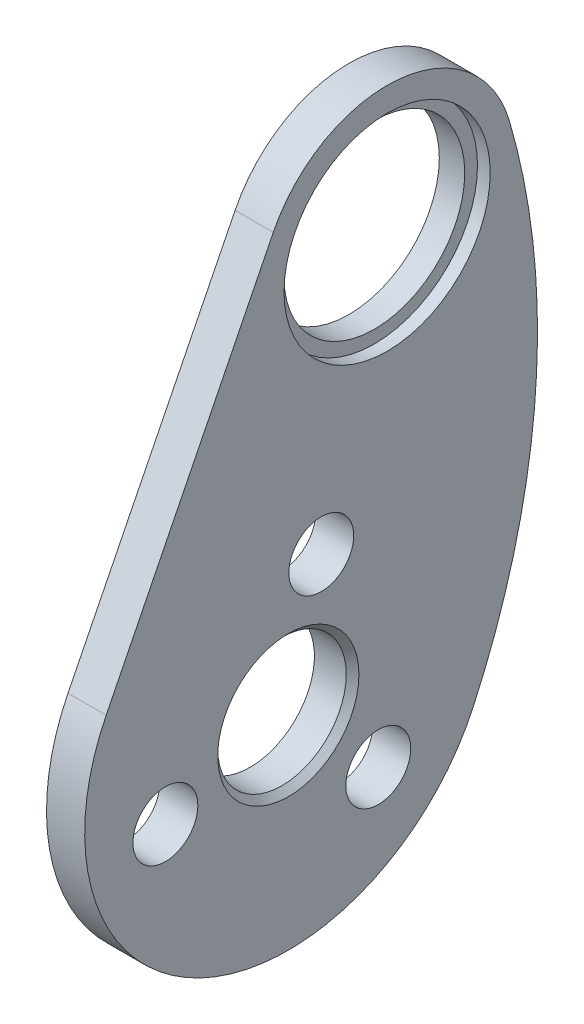
ISO-10303-21;
HEADER;
FILE_DESCRIPTION(('STEP AP214'),'2;1');
FILE_NAME('part.step','',(''),(''),'','','');
FILE_SCHEMA(('AUTOMOTIVE_DESIGN { 1 0 10303 214 1 1 1 1 }'));
ENDSEC;
DATA;
#1=APPLICATION_CONTEXT('core data for automotive mechanical design processes');
#2=APPLICATION_PROTOCOL_DEFINITION('international standard','automotive_design',2000,#1);
#3=PRODUCT_CONTEXT('',#1,'mechanical');
#4=PRODUCT('Part','Part','',(#3));
#5=PRODUCT_RELATED_PRODUCT_CATEGORY('part','',(#4));
#6=PRODUCT_DEFINITION_FORMATION('','',#4);
#7=PRODUCT_DEFINITION_CONTEXT('part definition',#1,'design');
#8=PRODUCT_DEFINITION('design','',#6,#7);
#9=PRODUCT_DEFINITION_SHAPE('','',#8);
#10=(LENGTH_UNIT() NAMED_UNIT(*) SI_UNIT(.MILLI.,.METRE.));
#11=(NAMED_UNIT(*) PLANE_ANGLE_UNIT() SI_UNIT($,.RADIAN.));
#12=(NAMED_UNIT(*) SI_UNIT($,.STERADIAN.) SOLID_ANGLE_UNIT());
#13=UNCERTAINTY_MEASURE_WITH_UNIT(LENGTH_MEASURE(1.E-05),#10,'distance_accuracy_value','');
#14=(GEOMETRIC_REPRESENTATION_CONTEXT(3) GLOBAL_UNCERTAINTY_ASSIGNED_CONTEXT((#13)) GLOBAL_UNIT_ASSIGNED_CONTEXT((#10,
#11,#12)) REPRESENTATION_CONTEXT('',''));
#15=CARTESIAN_POINT('',(0.,0.,0.));
#16=DIRECTION('',(0.,0.,1.));
#17=DIRECTION('',(1.,0.,0.));
#18=AXIS2_PLACEMENT_3D('',#15,#16,#17);
#19=CARTESIAN_POINT('',(3.,-12.6543120235321,43.1841219340059));
#20=DIRECTION('',(-1.,0.,0.));
#21=DIRECTION('',(0.,0.,1.));
#22=AXIS2_PLACEMENT_3D('',#19,#20,#21);
#23=CYLINDRICAL_SURFACE('',#22,55.);
#24=CARTESIAN_POINT('',(0.,-12.6543120235321,43.1841219340059));
#25=DIRECTION('',(1.,0.,0.));
#26=DIRECTION('',(0.,0.,-1.));
#27=AXIS2_PLACEMENT_3D('',#24,#25,#26);
#28=CIRCLE('',#27,55.);
#29=CARTESIAN_POINT('',(0.,-35.6745800256526,-6.76652632115234));
#30=VERTEX_POINT('',#29);
#31=CARTESIAN_POINT('',(0.,2.81206933856268,-9.59647154089021));
#32=VERTEX_POINT('',#31);
#33=EDGE_CURVE('E106',#30,#32,#28,.T.);
#34=ORIENTED_EDGE('',*,*,#33,.T.);
#35=DIRECTION('',(-1.,0.,0.));
#36=VECTOR('',#35,1.);
#37=CARTESIAN_POINT('',(3.,2.81206933856268,-9.59647154089021));
#38=LINE('',#37,#36);
#39=CARTESIAN_POINT('',(3.,2.81206933856268,-9.59647154089021));
#40=VERTEX_POINT('',#39);
#41=EDGE_CURVE('E97',#40,#32,#38,.T.);
#42=ORIENTED_EDGE('',*,*,#41,.F.);
#43=CARTESIAN_POINT('',(3.,-12.6543120235321,43.1841219340059));
#44=DIRECTION('',(1.,0.,0.));
#45=DIRECTION('',(0.,0.,-1.));
#46=AXIS2_PLACEMENT_3D('',#43,#44,#45);
#47=CIRCLE('',#46,55.);
#48=CARTESIAN_POINT('',(3.,-35.6745800256526,-6.76652632115234));
#49=VERTEX_POINT('',#48);
#50=EDGE_CURVE('E91',#49,#40,#47,.T.);
#51=ORIENTED_EDGE('',*,*,#50,.F.);
#52=DIRECTION('',(-1.,0.,0.));
#53=VECTOR('',#52,1.);
#54=CARTESIAN_POINT('',(3.,-35.6745800256526,-6.76652632115234));
#55=LINE('',#54,#53);
#56=EDGE_CURVE('E102',#49,#30,#55,.T.);
#57=ORIENTED_EDGE('',*,*,#56,.T.);
#58=EDGE_LOOP('',(#34,#42,#51,#57));
#59=FACE_BOUND('',#58,.T.);
#60=ADVANCED_FACE('F37',(#59),#23,.T.);
#61=CARTESIAN_POINT('',(3.,0.,0.));
#62=DIRECTION('',(-1.,0.,0.));
#63=DIRECTION('',(0.,0.,1.));
#64=AXIS2_PLACEMENT_3D('',#61,#62,#63);
#65=CYLINDRICAL_SURFACE('',#64,10.);
#66=CARTESIAN_POINT('',(0.,0.,0.));
#67=DIRECTION('',(1.,0.,0.));
#68=DIRECTION('',(0.,0.,-1.));
#69=AXIS2_PLACEMENT_3D('',#66,#67,#68);
#70=CIRCLE('',#69,10.);
#71=CARTESIAN_POINT('',(0.,4.46775003744035,8.94646352493273));
#72=VERTEX_POINT('',#71);
#73=EDGE_CURVE('E96',#32,#72,#70,.T.);
#74=ORIENTED_EDGE('',*,*,#73,.T.);
#75=DIRECTION('',(-1.,0.,0.));
#76=VECTOR('',#75,1.);
#77=CARTESIAN_POINT('',(3.,4.46775003744035,8.94646352493273));
#78=LINE('',#77,#76);
#79=CARTESIAN_POINT('',(3.,4.46775003744035,8.94646352493273));
#80=VERTEX_POINT('',#79);
#81=EDGE_CURVE('E94',#80,#72,#78,.T.);
#82=ORIENTED_EDGE('',*,*,#81,.F.);
#83=CARTESIAN_POINT('',(3.,0.,0.));
#84=DIRECTION('',(1.,0.,0.));
#85=DIRECTION('',(0.,0.,-1.));
#86=AXIS2_PLACEMENT_3D('',#83,#84,#85);
#87=CIRCLE('',#86,10.);
#88=EDGE_CURVE('E86',#40,#80,#87,.T.);
#89=ORIENTED_EDGE('',*,*,#88,.F.);
#90=ORIENTED_EDGE('',*,*,#41,.T.);
#91=EDGE_LOOP('',(#74,#82,#89,#90));
#92=FACE_BOUND('',#91,.T.);
#93=ADVANCED_FACE('F95',(#92),#65,.T.);
#94=CARTESIAN_POINT('',(3.,4.46775003744035,8.94646352493273));
#95=DIRECTION('',(0.,-0.446775003744035,-0.894646352493273));
#96=DIRECTION('',(0.,0.894646352493273,-0.446775003744035));
#97=AXIS2_PLACEMENT_3D('',#94,#95,#96);
#98=PLANE('',#97);
#99=DIRECTION('',(0.,-0.894646352493273,0.446775003744035));
#100=VECTOR('',#99,1.);
#101=CARTESIAN_POINT('',(0.,4.46775003744035,8.94646352493273));
#102=LINE('',#101,#100);
#103=CARTESIAN_POINT('',(0.,-21.8293747287675,22.0789129929679));
#104=VERTEX_POINT('',#103);
#105=EDGE_CURVE('E72',#72,#104,#102,.T.);
#106=ORIENTED_EDGE('',*,*,#105,.T.);
#107=DIRECTION('',(-1.,0.,0.));
#108=VECTOR('',#107,1.);
#109=CARTESIAN_POINT('',(3.,-21.8293747287675,22.0789129929679));
#110=LINE('',#109,#108);
#111=CARTESIAN_POINT('',(3.,-21.8293747287675,22.0789129929679));
#112=VERTEX_POINT('',#111);
#113=EDGE_CURVE('E98',#112,#104,#110,.T.);
#114=ORIENTED_EDGE('',*,*,#113,.F.);
#115=DIRECTION('',(0.,-0.894646352493273,0.446775003744035));
#116=VECTOR('',#115,1.);
#117=CARTESIAN_POINT('',(3.,4.46775003744035,8.94646352493273));
#118=LINE('',#117,#116);
#119=EDGE_CURVE('E89',#80,#112,#118,.T.);
#120=ORIENTED_EDGE('',*,*,#119,.F.);
#121=ORIENTED_EDGE('',*,*,#81,.T.);
#122=EDGE_LOOP('',(#106,#114,#120,#121));
#123=FACE_BOUND('',#122,.T.);
#124=ADVANCED_FACE('F100',(#123),#98,.F.);
#125=CARTESIAN_POINT('',(3.,-28.9777747886721,7.76457135307553));
#126=DIRECTION('',(-1.,0.,0.));
#127=DIRECTION('',(0.,0.,1.));
#128=AXIS2_PLACEMENT_3D('',#125,#126,#127);
#129=CYLINDRICAL_SURFACE('',#128,16.);
#130=CARTESIAN_POINT('',(0.,-28.9777747886721,7.76457135307553));
#131=DIRECTION('',(1.,0.,0.));
#132=DIRECTION('',(0.,0.,-1.));
#133=AXIS2_PLACEMENT_3D('',#130,#131,#132);
#134=CIRCLE('',#133,16.);
#135=EDGE_CURVE('E78',#104,#30,#134,.T.);
#136=ORIENTED_EDGE('',*,*,#135,.T.);
#137=ORIENTED_EDGE('',*,*,#56,.F.);
#138=CARTESIAN_POINT('',(3.,-28.9777747886721,7.76457135307553));
#139=DIRECTION('',(1.,0.,0.));
#140=DIRECTION('',(0.,0.,-1.));
#141=AXIS2_PLACEMENT_3D('',#138,#139,#140);
#142=CIRCLE('',#141,16.);
#143=EDGE_CURVE('E55',#112,#49,#142,.T.);
#144=ORIENTED_EDGE('',*,*,#143,.F.);
#145=ORIENTED_EDGE('',*,*,#113,.T.);
#146=EDGE_LOOP('',(#136,#137,#144,#145));
#147=FACE_BOUND('',#146,.T.);
#148=ADVANCED_FACE('F146',(#147),#129,.T.);
#149=CARTESIAN_POINT('',(3.,0.,0.));
#150=DIRECTION('',(1.,0.,0.));
#151=DIRECTION('',(0.,0.,-1.));
#152=AXIS2_PLACEMENT_3D('',#149,#150,#151);
#153=PLANE('',#152);
#154=CARTESIAN_POINT('',(3.,0.,0.));
#155=DIRECTION('',(-1.,0.,0.));
#156=DIRECTION('',(0.,0.,1.));
#157=AXIS2_PLACEMENT_3D('',#154,#155,#156);
#158=CIRCLE('',#157,8.1);
#159=CARTESIAN_POINT('',(3.,0.,8.1));
#160=VERTEX_POINT('',#159);
#161=EDGE_CURVE('E179',#160,#160,#158,.T.);
#162=ORIENTED_EDGE('',*,*,#161,.T.);
#163=EDGE_LOOP('',(#162));
#164=FACE_BOUND('',#163,.T.);
#165=CARTESIAN_POINT('',(3.,-28.9777747886721,7.76457135307553));
#166=DIRECTION('',(1.,0.,0.));
#167=DIRECTION('',(0.,0.,-1.));
#168=AXIS2_PLACEMENT_3D('',#165,#166,#167);
#169=CIRCLE('',#168,5.55000000000001);
#170=CARTESIAN_POINT('',(3.,-28.9777747886721,2.21457135307551));
#171=VERTEX_POINT('',#170);
#172=EDGE_CURVE('E11',#171,#171,#169,.F.);
#173=ORIENTED_EDGE('',*,*,#172,.T.);
#174=EDGE_LOOP('',(#173));
#175=FACE_BOUND('',#174,.T.);
#176=CARTESIAN_POINT('',(3.,-36.0488426005375,0.693503541210037));
#177=DIRECTION('',(1.,0.,0.));
#178=DIRECTION('',(0.,0.,-1.));
#179=AXIS2_PLACEMENT_3D('',#176,#177,#178);
#180=CIRCLE('',#179,2.55);
#181=CARTESIAN_POINT('',(3.,-36.0488426005375,-1.85649645878996));
#182=VERTEX_POINT('',#181);
#183=EDGE_CURVE('E192',#182,#182,#180,.T.);
#184=ORIENTED_EDGE('',*,*,#183,.F.);
#185=EDGE_LOOP('',(#184));
#186=FACE_BOUND('',#185,.T.);
#187=CARTESIAN_POINT('',(3.,-31.5659652396973,17.4238296159662));
#188=DIRECTION('',(1.,0.,0.));
#189=DIRECTION('',(0.,0.,-1.));
#190=AXIS2_PLACEMENT_3D('',#187,#188,#189);
#191=CIRCLE('',#190,2.55);
#192=CARTESIAN_POINT('',(3.,-31.5659652396973,14.8738296159662));
#193=VERTEX_POINT('',#192);
#194=EDGE_CURVE('E186',#193,#193,#191,.T.);
#195=ORIENTED_EDGE('',*,*,#194,.F.);
#196=EDGE_LOOP('',(#195));
#197=FACE_BOUND('',#196,.T.);
#198=CARTESIAN_POINT('',(3.,-19.3185165257814,5.17638090205038));
#199=DIRECTION('',(1.,0.,0.));
#200=DIRECTION('',(0.,0.,-1.));
#201=AXIS2_PLACEMENT_3D('',#198,#199,#200);
#202=CIRCLE('',#201,2.55);
#203=CARTESIAN_POINT('',(3.,-19.3185165257814,2.62638090205038));
#204=VERTEX_POINT('',#203);
#205=EDGE_CURVE('E198',#204,#204,#202,.T.);
#206=ORIENTED_EDGE('',*,*,#205,.F.);
#207=EDGE_LOOP('',(#206));
#208=FACE_BOUND('',#207,.T.);
#209=ORIENTED_EDGE('',*,*,#50,.T.);
#210=ORIENTED_EDGE('',*,*,#88,.T.);
#211=ORIENTED_EDGE('',*,*,#119,.T.);
#212=ORIENTED_EDGE('',*,*,#143,.T.);
#213=EDGE_LOOP('',(#209,#210,#211,#212));
#214=FACE_BOUND('',#213,.T.);
#215=ADVANCED_FACE('F87',(#164,#175,#186,#197,#208,#214),#153,.T.);
#216=CARTESIAN_POINT('',(0.,0.,0.));
#217=DIRECTION('',(1.,0.,0.));
#218=DIRECTION('',(0.,0.,-1.));
#219=AXIS2_PLACEMENT_3D('',#216,#217,#218);
#220=PLANE('',#219);
#221=CARTESIAN_POINT('',(0.,-36.0488426005375,0.693503541210037));
#222=DIRECTION('',(-1.,0.,0.));
#223=DIRECTION('',(0.,0.866025403784436,-0.500000000000004));
#224=AXIS2_PLACEMENT_3D('',#221,#222,#223);
#225=CIRCLE('',#224,2.55);
#226=CARTESIAN_POINT('',(0.,-33.8404778208872,-0.581496458789974));
#227=VERTEX_POINT('',#226);
#228=EDGE_CURVE('E183',#227,#227,#225,.T.);
#229=ORIENTED_EDGE('',*,*,#228,.F.);
#230=EDGE_LOOP('',(#229));
#231=FACE_BOUND('',#230,.T.);
#232=CARTESIAN_POINT('',(0.,-31.5659652396973,17.4238296159662));
#233=DIRECTION('',(-1.,0.,0.));
#234=DIRECTION('',(0.,-0.866025403784443,-0.499999999999992));
#235=AXIS2_PLACEMENT_3D('',#232,#233,#234);
#236=CIRCLE('',#235,2.55);
#237=CARTESIAN_POINT('',(0.,-33.7743300193476,16.1488296159662));
#238=VERTEX_POINT('',#237);
#239=EDGE_CURVE('E187',#238,#238,#236,.T.);
#240=ORIENTED_EDGE('',*,*,#239,.F.);
#241=EDGE_LOOP('',(#240));
#242=FACE_BOUND('',#241,.T.);
#243=CARTESIAN_POINT('',(0.,-19.3185165257814,5.17638090205038));
#244=DIRECTION('',(-1.,0.,0.));
#245=DIRECTION('',(0.,0.,1.));
#246=AXIS2_PLACEMENT_3D('',#243,#244,#245);
#247=CIRCLE('',#246,2.55);
#248=CARTESIAN_POINT('',(0.,-19.3185165257814,7.72638090205038));
#249=VERTEX_POINT('',#248);
#250=EDGE_CURVE('E195',#249,#249,#247,.T.);
#251=ORIENTED_EDGE('',*,*,#250,.F.);
#252=EDGE_LOOP('',(#251));
#253=FACE_BOUND('',#252,.T.);
#254=CARTESIAN_POINT('',(0.,0.,0.));
#255=DIRECTION('',(-1.,0.,0.));
#256=DIRECTION('',(0.,0.,1.));
#257=AXIS2_PLACEMENT_3D('',#254,#255,#256);
#258=CIRCLE('',#257,7.1);
#259=CARTESIAN_POINT('',(0.,0.,7.1));
#260=VERTEX_POINT('',#259);
#261=EDGE_CURVE('E109',#260,#260,#258,.T.);
#262=ORIENTED_EDGE('',*,*,#261,.F.);
#263=EDGE_LOOP('',(#262));
#264=FACE_BOUND('',#263,.T.);
#265=CARTESIAN_POINT('',(0.,-28.9777747886721,7.76457135307553));
#266=DIRECTION('',(-1.,0.,0.));
#267=DIRECTION('',(0.,0.,1.));
#268=AXIS2_PLACEMENT_3D('',#265,#266,#267);
#269=CIRCLE('',#268,5.05);
#270=CARTESIAN_POINT('',(0.,-28.9777747886721,12.8145713530755));
#271=VERTEX_POINT('',#270);
#272=EDGE_CURVE('E201',#271,#271,#269,.T.);
#273=ORIENTED_EDGE('',*,*,#272,.F.);
#274=EDGE_LOOP('',(#273));
#275=FACE_BOUND('',#274,.T.);
#276=ORIENTED_EDGE('',*,*,#33,.F.);
#277=ORIENTED_EDGE('',*,*,#135,.F.);
#278=ORIENTED_EDGE('',*,*,#105,.F.);
#279=ORIENTED_EDGE('',*,*,#73,.F.);
#280=EDGE_LOOP('',(#276,#277,#278,#279));
#281=FACE_BOUND('',#280,.T.);
#282=ADVANCED_FACE('F149',(#231,#242,#253,#264,#275,#281),#220,.F.);
#283=CARTESIAN_POINT('',(10.,-28.9777747886721,7.76457135307553));
#284=DIRECTION('',(-1.,0.,0.));
#285=DIRECTION('',(0.,0.,1.));
#286=AXIS2_PLACEMENT_3D('',#283,#284,#285);
#287=CYLINDRICAL_SURFACE('',#286,5.05);
#288=CARTESIAN_POINT('',(2.49999999999999,-28.9777747886721,7.76457135307553));
#289=DIRECTION('',(1.,0.,0.));
#290=DIRECTION('',(0.,0.,-1.));
#291=AXIS2_PLACEMENT_3D('',#288,#289,#290);
#292=CIRCLE('',#291,5.05);
#293=CARTESIAN_POINT('',(2.49999999999999,-28.9777747886721,2.71457135307552));
#294=VERTEX_POINT('',#293);
#295=EDGE_CURVE('E47',#294,#294,#292,.T.);
#296=ORIENTED_EDGE('',*,*,#295,.T.);
#297=EDGE_LOOP('',(#296));
#298=FACE_BOUND('',#297,.T.);
#299=ORIENTED_EDGE('',*,*,#272,.T.);
#300=EDGE_LOOP('',(#299));
#301=FACE_BOUND('',#300,.T.);
#302=ADVANCED_FACE('F119',(#298,#301),#287,.F.);
#303=CARTESIAN_POINT('',(10.,0.,0.));
#304=DIRECTION('',(-1.,0.,0.));
#305=DIRECTION('',(0.,0.,1.));
#306=AXIS2_PLACEMENT_3D('',#303,#304,#305);
#307=CYLINDRICAL_SURFACE('',#306,7.1);
#308=CARTESIAN_POINT('',(2.,0.,0.));
#309=DIRECTION('',(-1.,0.,0.));
#310=DIRECTION('',(0.,0.,1.));
#311=AXIS2_PLACEMENT_3D('',#308,#309,#310);
#312=CIRCLE('',#311,7.1);
#313=CARTESIAN_POINT('',(2.,0.,7.1));
#314=VERTEX_POINT('',#313);
#315=EDGE_CURVE('E41',#314,#314,#312,.F.);
#316=ORIENTED_EDGE('',*,*,#315,.T.);
#317=EDGE_LOOP('',(#316));
#318=FACE_BOUND('',#317,.T.);
#319=ORIENTED_EDGE('',*,*,#261,.T.);
#320=EDGE_LOOP('',(#319));
#321=FACE_BOUND('',#320,.T.);
#322=ADVANCED_FACE('F158',(#318,#321),#307,.F.);
#323=CARTESIAN_POINT('',(10.,-19.3185165257814,5.17638090205038));
#324=DIRECTION('',(-1.,0.,0.));
#325=DIRECTION('',(0.,0.,1.));
#326=AXIS2_PLACEMENT_3D('',#323,#324,#325);
#327=CYLINDRICAL_SURFACE('',#326,2.55);
#328=ORIENTED_EDGE('',*,*,#205,.T.);
#329=EDGE_LOOP('',(#328));
#330=FACE_BOUND('',#329,.T.);
#331=ORIENTED_EDGE('',*,*,#250,.T.);
#332=EDGE_LOOP('',(#331));
#333=FACE_BOUND('',#332,.T.);
#334=ADVANCED_FACE('F161',(#330,#333),#327,.F.);
#335=CARTESIAN_POINT('',(10.,-31.5659652396973,17.4238296159662));
#336=DIRECTION('',(-1.,0.,0.));
#337=DIRECTION('',(0.,0.,1.));
#338=AXIS2_PLACEMENT_3D('',#335,#336,#337);
#339=CYLINDRICAL_SURFACE('',#338,2.55);
#340=ORIENTED_EDGE('',*,*,#194,.T.);
#341=EDGE_LOOP('',(#340));
#342=FACE_BOUND('',#341,.T.);
#343=ORIENTED_EDGE('',*,*,#239,.T.);
#344=EDGE_LOOP('',(#343));
#345=FACE_BOUND('',#344,.T.);
#346=ADVANCED_FACE('F133',(#342,#345),#339,.F.);
#347=CARTESIAN_POINT('',(10.,-36.0488426005375,0.693503541210037));
#348=DIRECTION('',(-1.,0.,0.));
#349=DIRECTION('',(0.,0.,1.));
#350=AXIS2_PLACEMENT_3D('',#347,#348,#349);
#351=CYLINDRICAL_SURFACE('',#350,2.55);
#352=ORIENTED_EDGE('',*,*,#183,.T.);
#353=EDGE_LOOP('',(#352));
#354=FACE_BOUND('',#353,.T.);
#355=ORIENTED_EDGE('',*,*,#228,.T.);
#356=EDGE_LOOP('',(#355));
#357=FACE_BOUND('',#356,.T.);
#358=ADVANCED_FACE('F124',(#354,#357),#351,.F.);
#359=CARTESIAN_POINT('',(2.49999999999999,-28.9777747886721,7.76457135307553));
#360=DIRECTION('',(1.,0.,0.));
#361=DIRECTION('',(0.,0.,-1.));
#362=AXIS2_PLACEMENT_3D('',#359,#360,#361);
#363=CONICAL_SURFACE('',#362,5.05,0.785398163397452);
#364=ORIENTED_EDGE('',*,*,#172,.F.);
#365=EDGE_LOOP('',(#364));
#366=FACE_BOUND('',#365,.T.);
#367=ORIENTED_EDGE('',*,*,#295,.F.);
#368=EDGE_LOOP('',(#367));
#369=FACE_BOUND('',#368,.T.);
#370=ADVANCED_FACE('F39',(#366,#369),#363,.F.);
#371=CARTESIAN_POINT('',(2.,0.,0.));
#372=DIRECTION('',(-1.,0.,0.));
#373=DIRECTION('',(0.,0.,1.));
#374=AXIS2_PLACEMENT_3D('',#371,#372,#373);
#375=PLANE('',#374);
#376=CARTESIAN_POINT('',(2.,0.,0.));
#377=DIRECTION('',(-1.,0.,0.));
#378=DIRECTION('',(0.,0.,1.));
#379=AXIS2_PLACEMENT_3D('',#376,#377,#378);
#380=CIRCLE('',#379,8.1);
#381=CARTESIAN_POINT('',(2.,0.,8.1));
#382=VERTEX_POINT('',#381);
#383=EDGE_CURVE('E176',#382,#382,#380,.T.);
#384=ORIENTED_EDGE('',*,*,#383,.F.);
#385=EDGE_LOOP('',(#384));
#386=FACE_BOUND('',#385,.T.);
#387=ORIENTED_EDGE('',*,*,#315,.F.);
#388=EDGE_LOOP('',(#387));
#389=FACE_BOUND('',#388,.T.);
#390=ADVANCED_FACE('F123',(#386,#389),#375,.F.);
#391=CARTESIAN_POINT('',(2.,0.,0.));
#392=DIRECTION('',(1.,0.,0.));
#393=DIRECTION('',(0.,0.,-1.));
#394=AXIS2_PLACEMENT_3D('',#391,#392,#393);
#395=CYLINDRICAL_SURFACE('',#394,8.1);
#396=ORIENTED_EDGE('',*,*,#383,.T.);
#397=EDGE_LOOP('',(#396));
#398=FACE_BOUND('',#397,.T.);
#399=ORIENTED_EDGE('',*,*,#161,.F.);
#400=EDGE_LOOP('',(#399));
#401=FACE_BOUND('',#400,.T.);
#402=ADVANCED_FACE('F130',(#398,#401),#395,.F.);
#403=CLOSED_SHELL('',(#60,#93,#124,#148,#215,#282,#302,#322,#334,#346,#358,#370,#390,#402));
#404=MANIFOLD_SOLID_BREP('B2',#403);
#405=ADVANCED_BREP_SHAPE_REPRESENTATION('',(#18,#404),#14);
#406=SHAPE_DEFINITION_REPRESENTATION(#9,#405);
ENDSEC;
END-ISO-10303-21;
